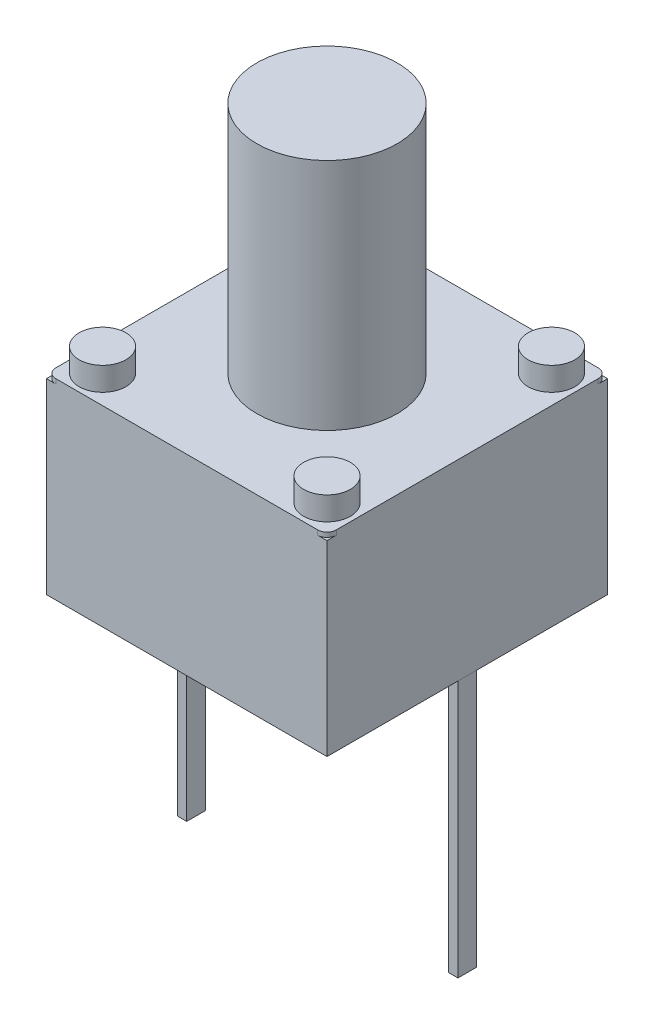
ISO-10303-21;
HEADER;
FILE_DESCRIPTION(('STEP AP214'),'2;1');
FILE_NAME('part.step','',(''),(''),'','','');
FILE_SCHEMA(('AUTOMOTIVE_DESIGN { 1 0 10303 214 1 1 1 1 }'));
ENDSEC;
DATA;
#1=APPLICATION_CONTEXT('core data for automotive mechanical design processes');
#2=APPLICATION_PROTOCOL_DEFINITION('international standard','automotive_design',2000,#1);
#3=PRODUCT_CONTEXT('',#1,'mechanical');
#4=PRODUCT('Part','Part','',(#3));
#5=PRODUCT_RELATED_PRODUCT_CATEGORY('part','',(#4));
#6=PRODUCT_DEFINITION_FORMATION('','',#4);
#7=PRODUCT_DEFINITION_CONTEXT('part definition',#1,'design');
#8=PRODUCT_DEFINITION('design','',#6,#7);
#9=PRODUCT_DEFINITION_SHAPE('','',#8);
#10=(LENGTH_UNIT() NAMED_UNIT(*) SI_UNIT(.MILLI.,.METRE.));
#11=(NAMED_UNIT(*) PLANE_ANGLE_UNIT() SI_UNIT($,.RADIAN.));
#12=(NAMED_UNIT(*) SI_UNIT($,.STERADIAN.) SOLID_ANGLE_UNIT());
#13=UNCERTAINTY_MEASURE_WITH_UNIT(LENGTH_MEASURE(1.E-05),#10,'distance_accuracy_value','');
#14=(GEOMETRIC_REPRESENTATION_CONTEXT(3) GLOBAL_UNCERTAINTY_ASSIGNED_CONTEXT((#13)) GLOBAL_UNIT_ASSIGNED_CONTEXT((#10,
#11,#12)) REPRESENTATION_CONTEXT('',''));
#15=CARTESIAN_POINT('',(0.,0.,0.));
#16=DIRECTION('',(0.,0.,1.));
#17=DIRECTION('',(1.,0.,0.));
#18=AXIS2_PLACEMENT_3D('',#15,#16,#17);
#19=CARTESIAN_POINT('',(6.,-5.5,-3.2));
#20=DIRECTION('',(0.,0.,1.));
#21=DIRECTION('',(1.,0.,0.));
#22=AXIS2_PLACEMENT_3D('',#19,#20,#21);
#23=PLANE('',#22);
#24=DIRECTION('',(1.,0.,0.));
#25=VECTOR('',#24,1.);
#26=CARTESIAN_POINT('',(6.,0.,-3.2));
#27=LINE('',#26,#25);
#28=CARTESIAN_POINT('',(5.8,0.,-3.2));
#29=VERTEX_POINT('',#28);
#30=CARTESIAN_POINT('',(6.,0.,-3.2));
#31=VERTEX_POINT('',#30);
#32=EDGE_CURVE('E107',#29,#31,#27,.T.);
#33=ORIENTED_EDGE('',*,*,#32,.T.);
#34=DIRECTION('',(0.,1.,0.));
#35=VECTOR('',#34,1.);
#36=CARTESIAN_POINT('',(6.,-5.5,-3.2));
#37=LINE('',#36,#35);
#38=CARTESIAN_POINT('',(6.,-5.5,-3.2));
#39=VERTEX_POINT('',#38);
#40=EDGE_CURVE('E12',#39,#31,#37,.T.);
#41=ORIENTED_EDGE('',*,*,#40,.F.);
#42=DIRECTION('',(1.,0.,0.));
#43=VECTOR('',#42,1.);
#44=CARTESIAN_POINT('',(6.,-5.5,-3.2));
#45=LINE('',#44,#43);
#46=CARTESIAN_POINT('',(5.8,-5.5,-3.2));
#47=VERTEX_POINT('',#46);
#48=EDGE_CURVE('E95',#47,#39,#45,.T.);
#49=ORIENTED_EDGE('',*,*,#48,.F.);
#50=DIRECTION('',(0.,1.,0.));
#51=VECTOR('',#50,1.);
#52=CARTESIAN_POINT('',(5.8,-5.5,-3.2));
#53=LINE('',#52,#51);
#54=EDGE_CURVE('E103',#47,#29,#53,.T.);
#55=ORIENTED_EDGE('',*,*,#54,.T.);
#56=EDGE_LOOP('',(#33,#41,#49,#55));
#57=FACE_BOUND('',#56,.T.);
#58=ADVANCED_FACE('F44',(#57),#23,.F.);
#59=CARTESIAN_POINT('',(6.,-5.5,-3.2));
#60=DIRECTION('',(-1.,0.,0.));
#61=DIRECTION('',(0.,0.,1.));
#62=AXIS2_PLACEMENT_3D('',#59,#60,#61);
#63=PLANE('',#62);
#64=DIRECTION('',(0.,0.,1.));
#65=VECTOR('',#64,1.);
#66=CARTESIAN_POINT('',(6.,0.,-3.2));
#67=LINE('',#66,#65);
#68=CARTESIAN_POINT('',(6.,0.,-2.8));
#69=VERTEX_POINT('',#68);
#70=EDGE_CURVE('E99',#31,#69,#67,.T.);
#71=ORIENTED_EDGE('',*,*,#70,.T.);
#72=DIRECTION('',(0.,1.,0.));
#73=VECTOR('',#72,1.);
#74=CARTESIAN_POINT('',(6.,-5.5,-2.8));
#75=LINE('',#74,#73);
#76=CARTESIAN_POINT('',(6.,-5.5,-2.8));
#77=VERTEX_POINT('',#76);
#78=EDGE_CURVE('E52',#77,#69,#75,.T.);
#79=ORIENTED_EDGE('',*,*,#78,.F.);
#80=DIRECTION('',(0.,0.,1.));
#81=VECTOR('',#80,1.);
#82=CARTESIAN_POINT('',(6.,-5.5,-3.2));
#83=LINE('',#82,#81);
#84=EDGE_CURVE('E90',#39,#77,#83,.T.);
#85=ORIENTED_EDGE('',*,*,#84,.F.);
#86=ORIENTED_EDGE('',*,*,#40,.T.);
#87=EDGE_LOOP('',(#71,#79,#85,#86));
#88=FACE_BOUND('',#87,.T.);
#89=ADVANCED_FACE('F98',(#88),#63,.F.);
#90=CARTESIAN_POINT('',(6.,-5.5,-2.8));
#91=DIRECTION('',(0.,0.,-1.));
#92=DIRECTION('',(-1.,0.,0.));
#93=AXIS2_PLACEMENT_3D('',#90,#91,#92);
#94=PLANE('',#93);
#95=DIRECTION('',(-1.,0.,0.));
#96=VECTOR('',#95,1.);
#97=CARTESIAN_POINT('',(6.,0.,-2.8));
#98=LINE('',#97,#96);
#99=CARTESIAN_POINT('',(5.8,0.,-2.8));
#100=VERTEX_POINT('',#99);
#101=EDGE_CURVE('E77',#69,#100,#98,.T.);
#102=ORIENTED_EDGE('',*,*,#101,.T.);
#103=DIRECTION('',(0.,1.,0.));
#104=VECTOR('',#103,1.);
#105=CARTESIAN_POINT('',(5.8,-5.5,-2.8));
#106=LINE('',#105,#104);
#107=CARTESIAN_POINT('',(5.8,-5.5,-2.8));
#108=VERTEX_POINT('',#107);
#109=EDGE_CURVE('E100',#108,#100,#106,.T.);
#110=ORIENTED_EDGE('',*,*,#109,.F.);
#111=DIRECTION('',(-1.,0.,0.));
#112=VECTOR('',#111,1.);
#113=CARTESIAN_POINT('',(6.,-5.5,-2.8));
#114=LINE('',#113,#112);
#115=EDGE_CURVE('E93',#77,#108,#114,.T.);
#116=ORIENTED_EDGE('',*,*,#115,.F.);
#117=ORIENTED_EDGE('',*,*,#78,.T.);
#118=EDGE_LOOP('',(#102,#110,#116,#117));
#119=FACE_BOUND('',#118,.T.);
#120=ADVANCED_FACE('F101',(#119),#94,.F.);
#121=CARTESIAN_POINT('',(5.8,-5.5,-3.2));
#122=DIRECTION('',(1.,0.,0.));
#123=DIRECTION('',(0.,0.,-1.));
#124=AXIS2_PLACEMENT_3D('',#121,#122,#123);
#125=PLANE('',#124);
#126=DIRECTION('',(0.,0.,-1.));
#127=VECTOR('',#126,1.);
#128=CARTESIAN_POINT('',(5.8,0.,-3.2));
#129=LINE('',#128,#127);
#130=EDGE_CURVE('E83',#100,#29,#129,.T.);
#131=ORIENTED_EDGE('',*,*,#130,.T.);
#132=ORIENTED_EDGE('',*,*,#54,.F.);
#133=DIRECTION('',(0.,0.,-1.));
#134=VECTOR('',#133,1.);
#135=CARTESIAN_POINT('',(5.8,-5.5,-3.2));
#136=LINE('',#135,#134);
#137=EDGE_CURVE('E60',#108,#47,#136,.T.);
#138=ORIENTED_EDGE('',*,*,#137,.F.);
#139=ORIENTED_EDGE('',*,*,#109,.T.);
#140=EDGE_LOOP('',(#131,#132,#138,#139));
#141=FACE_BOUND('',#140,.T.);
#142=ADVANCED_FACE('F114',(#141),#125,.F.);
#143=CARTESIAN_POINT('',(0.,-5.5,0.));
#144=DIRECTION('',(0.,1.,0.));
#145=DIRECTION('',(0.,0.,1.));
#146=AXIS2_PLACEMENT_3D('',#143,#144,#145);
#147=PLANE('',#146);
#148=ORIENTED_EDGE('',*,*,#48,.T.);
#149=ORIENTED_EDGE('',*,*,#84,.T.);
#150=ORIENTED_EDGE('',*,*,#115,.T.);
#151=ORIENTED_EDGE('',*,*,#137,.T.);
#152=EDGE_LOOP('',(#148,#149,#150,#151));
#153=FACE_BOUND('',#152,.T.);
#154=ADVANCED_FACE('F91',(#153),#147,.F.);
#155=CARTESIAN_POINT('',(0.,0.,0.));
#156=DIRECTION('',(0.,1.,0.));
#157=DIRECTION('',(0.,0.,1.));
#158=AXIS2_PLACEMENT_3D('',#155,#156,#157);
#159=PLANE('',#158);
#160=ORIENTED_EDGE('',*,*,#32,.F.);
#161=ORIENTED_EDGE('',*,*,#130,.F.);
#162=ORIENTED_EDGE('',*,*,#101,.F.);
#163=ORIENTED_EDGE('',*,*,#70,.F.);
#164=EDGE_LOOP('',(#160,#161,#162,#163));
#165=FACE_BOUND('',#164,.T.);
#166=ADVANCED_FACE('F117',(#165),#159,.T.);
#167=CLOSED_SHELL('',(#58,#89,#120,#142,#154,#166));
#168=MANIFOLD_SOLID_BREP('B2',#167);
#169=CARTESIAN_POINT('',(0.,-5.5,-3.2));
#170=DIRECTION('',(1.,0.,0.));
#171=DIRECTION('',(0.,0.,-1.));
#172=AXIS2_PLACEMENT_3D('',#169,#170,#171);
#173=PLANE('',#172);
#174=DIRECTION('',(0.,0.,-1.));
#175=VECTOR('',#174,1.);
#176=CARTESIAN_POINT('',(0.,0.,-3.2));
#177=LINE('',#176,#175);
#178=CARTESIAN_POINT('',(0.,0.,-2.8));
#179=VERTEX_POINT('',#178);
#180=CARTESIAN_POINT('',(0.,0.,-3.2));
#181=VERTEX_POINT('',#180);
#182=EDGE_CURVE('E240',#179,#181,#177,.T.);
#183=ORIENTED_EDGE('',*,*,#182,.T.);
#184=DIRECTION('',(0.,1.,0.));
#185=VECTOR('',#184,1.);
#186=CARTESIAN_POINT('',(0.,-5.5,-3.2));
#187=LINE('',#186,#185);
#188=CARTESIAN_POINT('',(0.,-5.5,-3.2));
#189=VERTEX_POINT('',#188);
#190=EDGE_CURVE('E42',#189,#181,#187,.T.);
#191=ORIENTED_EDGE('',*,*,#190,.F.);
#192=DIRECTION('',(0.,0.,-1.));
#193=VECTOR('',#192,1.);
#194=CARTESIAN_POINT('',(0.,-5.5,-3.2));
#195=LINE('',#194,#193);
#196=CARTESIAN_POINT('',(0.,-5.5,-2.8));
#197=VERTEX_POINT('',#196);
#198=EDGE_CURVE('E228',#197,#189,#195,.T.);
#199=ORIENTED_EDGE('',*,*,#198,.F.);
#200=DIRECTION('',(0.,1.,0.));
#201=VECTOR('',#200,1.);
#202=CARTESIAN_POINT('',(0.,-5.5,-2.8));
#203=LINE('',#202,#201);
#204=EDGE_CURVE('E236',#197,#179,#203,.T.);
#205=ORIENTED_EDGE('',*,*,#204,.T.);
#206=EDGE_LOOP('',(#183,#191,#199,#205));
#207=FACE_BOUND('',#206,.T.);
#208=ADVANCED_FACE('F177',(#207),#173,.F.);
#209=CARTESIAN_POINT('',(0.,-5.5,-3.2));
#210=DIRECTION('',(0.,0.,1.));
#211=DIRECTION('',(1.,0.,0.));
#212=AXIS2_PLACEMENT_3D('',#209,#210,#211);
#213=PLANE('',#212);
#214=DIRECTION('',(1.,0.,0.));
#215=VECTOR('',#214,1.);
#216=CARTESIAN_POINT('',(0.,0.,-3.2));
#217=LINE('',#216,#215);
#218=CARTESIAN_POINT('',(0.2,0.,-3.2));
#219=VERTEX_POINT('',#218);
#220=EDGE_CURVE('E232',#181,#219,#217,.T.);
#221=ORIENTED_EDGE('',*,*,#220,.T.);
#222=DIRECTION('',(0.,1.,0.));
#223=VECTOR('',#222,1.);
#224=CARTESIAN_POINT('',(0.2,-5.5,-3.2));
#225=LINE('',#224,#223);
#226=CARTESIAN_POINT('',(0.2,-5.5,-3.2));
#227=VERTEX_POINT('',#226);
#228=EDGE_CURVE('E185',#227,#219,#225,.T.);
#229=ORIENTED_EDGE('',*,*,#228,.F.);
#230=DIRECTION('',(1.,0.,0.));
#231=VECTOR('',#230,1.);
#232=CARTESIAN_POINT('',(0.,-5.5,-3.2));
#233=LINE('',#232,#231);
#234=EDGE_CURVE('E223',#189,#227,#233,.T.);
#235=ORIENTED_EDGE('',*,*,#234,.F.);
#236=ORIENTED_EDGE('',*,*,#190,.T.);
#237=EDGE_LOOP('',(#221,#229,#235,#236));
#238=FACE_BOUND('',#237,.T.);
#239=ADVANCED_FACE('F231',(#238),#213,.F.);
#240=CARTESIAN_POINT('',(0.2,-5.5,-3.2));
#241=DIRECTION('',(-1.,0.,0.));
#242=DIRECTION('',(0.,0.,1.));
#243=AXIS2_PLACEMENT_3D('',#240,#241,#242);
#244=PLANE('',#243);
#245=DIRECTION('',(0.,0.,1.));
#246=VECTOR('',#245,1.);
#247=CARTESIAN_POINT('',(0.2,0.,-3.2));
#248=LINE('',#247,#246);
#249=CARTESIAN_POINT('',(0.2,0.,-2.8));
#250=VERTEX_POINT('',#249);
#251=EDGE_CURVE('E210',#219,#250,#248,.T.);
#252=ORIENTED_EDGE('',*,*,#251,.T.);
#253=DIRECTION('',(0.,1.,0.));
#254=VECTOR('',#253,1.);
#255=CARTESIAN_POINT('',(0.2,-5.5,-2.8));
#256=LINE('',#255,#254);
#257=CARTESIAN_POINT('',(0.2,-5.5,-2.8));
#258=VERTEX_POINT('',#257);
#259=EDGE_CURVE('E233',#258,#250,#256,.T.);
#260=ORIENTED_EDGE('',*,*,#259,.F.);
#261=DIRECTION('',(0.,0.,1.));
#262=VECTOR('',#261,1.);
#263=CARTESIAN_POINT('',(0.2,-5.5,-3.2));
#264=LINE('',#263,#262);
#265=EDGE_CURVE('E226',#227,#258,#264,.T.);
#266=ORIENTED_EDGE('',*,*,#265,.F.);
#267=ORIENTED_EDGE('',*,*,#228,.T.);
#268=EDGE_LOOP('',(#252,#260,#266,#267));
#269=FACE_BOUND('',#268,.T.);
#270=ADVANCED_FACE('F234',(#269),#244,.F.);
#271=CARTESIAN_POINT('',(0.,-5.5,-2.8));
#272=DIRECTION('',(0.,0.,-1.));
#273=DIRECTION('',(-1.,0.,0.));
#274=AXIS2_PLACEMENT_3D('',#271,#272,#273);
#275=PLANE('',#274);
#276=DIRECTION('',(-1.,0.,0.));
#277=VECTOR('',#276,1.);
#278=CARTESIAN_POINT('',(0.,0.,-2.8));
#279=LINE('',#278,#277);
#280=EDGE_CURVE('E216',#250,#179,#279,.T.);
#281=ORIENTED_EDGE('',*,*,#280,.T.);
#282=ORIENTED_EDGE('',*,*,#204,.F.);
#283=DIRECTION('',(-1.,0.,0.));
#284=VECTOR('',#283,1.);
#285=CARTESIAN_POINT('',(0.,-5.5,-2.8));
#286=LINE('',#285,#284);
#287=EDGE_CURVE('E193',#258,#197,#286,.T.);
#288=ORIENTED_EDGE('',*,*,#287,.F.);
#289=ORIENTED_EDGE('',*,*,#259,.T.);
#290=EDGE_LOOP('',(#281,#282,#288,#289));
#291=FACE_BOUND('',#290,.T.);
#292=ADVANCED_FACE('F247',(#291),#275,.F.);
#293=CARTESIAN_POINT('',(0.,-5.5,0.));
#294=DIRECTION('',(0.,1.,0.));
#295=DIRECTION('',(0.,0.,1.));
#296=AXIS2_PLACEMENT_3D('',#293,#294,#295);
#297=PLANE('',#296);
#298=ORIENTED_EDGE('',*,*,#198,.T.);
#299=ORIENTED_EDGE('',*,*,#234,.T.);
#300=ORIENTED_EDGE('',*,*,#265,.T.);
#301=ORIENTED_EDGE('',*,*,#287,.T.);
#302=EDGE_LOOP('',(#298,#299,#300,#301));
#303=FACE_BOUND('',#302,.T.);
#304=ADVANCED_FACE('F224',(#303),#297,.F.);
#305=CARTESIAN_POINT('',(0.,0.,0.));
#306=DIRECTION('',(0.,1.,0.));
#307=DIRECTION('',(0.,0.,1.));
#308=AXIS2_PLACEMENT_3D('',#305,#306,#307);
#309=PLANE('',#308);
#310=ORIENTED_EDGE('',*,*,#182,.F.);
#311=ORIENTED_EDGE('',*,*,#280,.F.);
#312=ORIENTED_EDGE('',*,*,#251,.F.);
#313=ORIENTED_EDGE('',*,*,#220,.F.);
#314=EDGE_LOOP('',(#310,#311,#312,#313));
#315=FACE_BOUND('',#314,.T.);
#316=ADVANCED_FACE('F250',(#315),#309,.T.);
#317=CLOSED_SHELL('',(#208,#239,#270,#292,#304,#316));
#318=MANIFOLD_SOLID_BREP('B6',#317);
#319=CARTESIAN_POINT('',(0.,4.,0.));
#320=DIRECTION('',(0.,-1.,0.));
#321=DIRECTION('',(0.,0.,-1.));
#322=AXIS2_PLACEMENT_3D('',#319,#320,#321);
#323=PLANE('',#322);
#324=CARTESIAN_POINT('',(0.2,4.,-0.2));
#325=DIRECTION('',(0.,1.,0.));
#326=DIRECTION('',(0.,0.,1.));
#327=AXIS2_PLACEMENT_3D('',#324,#325,#326);
#328=CIRCLE('',#327,0.2);
#329=CARTESIAN_POINT('',(0.,4.,-0.2));
#330=VERTEX_POINT('',#329);
#331=CARTESIAN_POINT('',(0.2,4.,0.));
#332=VERTEX_POINT('',#331);
#333=EDGE_CURVE('E416',#330,#332,#328,.T.);
#334=ORIENTED_EDGE('',*,*,#333,.F.);
#335=DIRECTION('',(0.,0.,1.));
#336=VECTOR('',#335,1.);
#337=CARTESIAN_POINT('',(0.,4.,0.));
#338=LINE('',#337,#336);
#339=CARTESIAN_POINT('',(0.,4.,0.));
#340=VERTEX_POINT('',#339);
#341=EDGE_CURVE('E489',#330,#340,#338,.T.);
#342=ORIENTED_EDGE('',*,*,#341,.T.);
#343=DIRECTION('',(1.,0.,0.));
#344=VECTOR('',#343,1.);
#345=CARTESIAN_POINT('',(0.,4.,0.));
#346=LINE('',#345,#344);
#347=EDGE_CURVE('E514',#340,#332,#346,.T.);
#348=ORIENTED_EDGE('',*,*,#347,.T.);
#349=EDGE_LOOP('',(#334,#342,#348));
#350=FACE_BOUND('',#349,.T.);
#351=ADVANCED_FACE('F301',(#350),#323,.F.);
#352=CARTESIAN_POINT('',(0.2,4.,-5.8));
#353=DIRECTION('',(0.,1.,0.));
#354=DIRECTION('',(0.,0.,1.));
#355=AXIS2_PLACEMENT_3D('',#352,#353,#354);
#356=CIRCLE('',#355,0.2);
#357=CARTESIAN_POINT('',(0.2,4.,-6.));
#358=VERTEX_POINT('',#357);
#359=CARTESIAN_POINT('',(0.,4.,-5.8));
#360=VERTEX_POINT('',#359);
#361=EDGE_CURVE('E318',#358,#360,#356,.T.);
#362=ORIENTED_EDGE('',*,*,#361,.F.);
#363=DIRECTION('',(-1.,0.,0.));
#364=VECTOR('',#363,1.);
#365=CARTESIAN_POINT('',(0.,4.,-6.));
#366=LINE('',#365,#364);
#367=CARTESIAN_POINT('',(0.,4.,-6.));
#368=VERTEX_POINT('',#367);
#369=EDGE_CURVE('E448',#358,#368,#366,.T.);
#370=ORIENTED_EDGE('',*,*,#369,.T.);
#371=EDGE_CURVE('E492',#368,#360,#338,.T.);
#372=ORIENTED_EDGE('',*,*,#371,.T.);
#373=EDGE_LOOP('',(#362,#370,#372));
#374=FACE_BOUND('',#373,.T.);
#375=ADVANCED_FACE('F550',(#374),#323,.F.);
#376=CARTESIAN_POINT('',(5.8,4.,-5.8));
#377=DIRECTION('',(0.,1.,0.));
#378=DIRECTION('',(0.,0.,-1.));
#379=AXIS2_PLACEMENT_3D('',#376,#377,#378);
#380=CIRCLE('',#379,0.2);
#381=CARTESIAN_POINT('',(6.,4.,-5.8));
#382=VERTEX_POINT('',#381);
#383=CARTESIAN_POINT('',(5.8,4.,-6.));
#384=VERTEX_POINT('',#383);
#385=EDGE_CURVE('E447',#382,#384,#380,.T.);
#386=ORIENTED_EDGE('',*,*,#385,.F.);
#387=DIRECTION('',(0.,0.,-1.));
#388=VECTOR('',#387,1.);
#389=CARTESIAN_POINT('',(6.,4.,0.));
#390=LINE('',#389,#388);
#391=CARTESIAN_POINT('',(6.,4.,-6.));
#392=VERTEX_POINT('',#391);
#393=EDGE_CURVE('E511',#382,#392,#390,.T.);
#394=ORIENTED_EDGE('',*,*,#393,.T.);
#395=EDGE_CURVE('E326',#392,#384,#366,.T.);
#396=ORIENTED_EDGE('',*,*,#395,.T.);
#397=EDGE_LOOP('',(#386,#394,#396));
#398=FACE_BOUND('',#397,.T.);
#399=ADVANCED_FACE('F552',(#398),#323,.F.);
#400=CARTESIAN_POINT('',(0.,4.,0.));
#401=DIRECTION('',(1.,0.,0.));
#402=DIRECTION('',(0.,0.,-1.));
#403=AXIS2_PLACEMENT_3D('',#400,#401,#402);
#404=PLANE('',#403);
#405=DIRECTION('',(0.,0.,1.));
#406=VECTOR('',#405,1.);
#407=CARTESIAN_POINT('',(0.,0.,0.));
#408=LINE('',#407,#406);
#409=CARTESIAN_POINT('',(0.,0.,-6.));
#410=VERTEX_POINT('',#409);
#411=CARTESIAN_POINT('',(0.,0.,0.));
#412=VERTEX_POINT('',#411);
#413=EDGE_CURVE('E417',#410,#412,#408,.T.);
#414=ORIENTED_EDGE('',*,*,#413,.T.);
#415=DIRECTION('',(0.,-1.,0.));
#416=VECTOR('',#415,1.);
#417=CARTESIAN_POINT('',(0.,4.,0.));
#418=LINE('',#417,#416);
#419=EDGE_CURVE('E175',#340,#412,#418,.T.);
#420=ORIENTED_EDGE('',*,*,#419,.F.);
#421=ORIENTED_EDGE('',*,*,#341,.F.);
#422=DIRECTION('',(0.,-1.,0.));
#423=VECTOR('',#422,1.);
#424=CARTESIAN_POINT('',(0.,4.1,-0.200000000000001));
#425=LINE('',#424,#423);
#426=CARTESIAN_POINT('',(0.,4.1,-0.200000000000001));
#427=VERTEX_POINT('',#426);
#428=EDGE_CURVE('E433',#427,#330,#425,.T.);
#429=ORIENTED_EDGE('',*,*,#428,.F.);
#430=DIRECTION('',(0.,0.,1.));
#431=VECTOR('',#430,1.);
#432=CARTESIAN_POINT('',(0.,4.1,-5.8));
#433=LINE('',#432,#431);
#434=CARTESIAN_POINT('',(0.,4.1,-5.8));
#435=VERTEX_POINT('',#434);
#436=EDGE_CURVE('E410',#435,#427,#433,.T.);
#437=ORIENTED_EDGE('',*,*,#436,.F.);
#438=DIRECTION('',(0.,-1.,0.));
#439=VECTOR('',#438,1.);
#440=CARTESIAN_POINT('',(0.,4.1,-5.8));
#441=LINE('',#440,#439);
#442=EDGE_CURVE('E475',#435,#360,#441,.T.);
#443=ORIENTED_EDGE('',*,*,#442,.T.);
#444=ORIENTED_EDGE('',*,*,#371,.F.);
#445=DIRECTION('',(0.,-1.,0.));
#446=VECTOR('',#445,1.);
#447=CARTESIAN_POINT('',(0.,4.,-6.));
#448=LINE('',#447,#446);
#449=EDGE_CURVE('E500',#368,#410,#448,.T.);
#450=ORIENTED_EDGE('',*,*,#449,.T.);
#451=EDGE_LOOP('',(#414,#420,#421,#429,#437,#443,#444,#450));
#452=FACE_BOUND('',#451,.T.);
#453=ADVANCED_FACE('F303',(#452),#404,.F.);
#454=CARTESIAN_POINT('',(0.,4.,0.));
#455=DIRECTION('',(0.,0.,-1.));
#456=DIRECTION('',(-1.,0.,0.));
#457=AXIS2_PLACEMENT_3D('',#454,#455,#456);
#458=PLANE('',#457);
#459=DIRECTION('',(1.,0.,0.));
#460=VECTOR('',#459,1.);
#461=CARTESIAN_POINT('',(0.,0.,0.));
#462=LINE('',#461,#460);
#463=CARTESIAN_POINT('',(6.,0.,0.));
#464=VERTEX_POINT('',#463);
#465=EDGE_CURVE('E420',#412,#464,#462,.T.);
#466=ORIENTED_EDGE('',*,*,#465,.T.);
#467=DIRECTION('',(0.,-1.,0.));
#468=VECTOR('',#467,1.);
#469=CARTESIAN_POINT('',(6.,4.,0.));
#470=LINE('',#469,#468);
#471=CARTESIAN_POINT('',(6.,4.,0.));
#472=VERTEX_POINT('',#471);
#473=EDGE_CURVE('E310',#472,#464,#470,.T.);
#474=ORIENTED_EDGE('',*,*,#473,.F.);
#475=CARTESIAN_POINT('',(5.8,4.,0.));
#476=VERTEX_POINT('',#475);
#477=EDGE_CURVE('E493',#476,#472,#346,.T.);
#478=ORIENTED_EDGE('',*,*,#477,.F.);
#479=DIRECTION('',(0.,-1.,0.));
#480=VECTOR('',#479,1.);
#481=CARTESIAN_POINT('',(5.8,4.1,0.));
#482=LINE('',#481,#480);
#483=CARTESIAN_POINT('',(5.8,4.1,0.));
#484=VERTEX_POINT('',#483);
#485=EDGE_CURVE('E401',#484,#476,#482,.T.);
#486=ORIENTED_EDGE('',*,*,#485,.F.);
#487=DIRECTION('',(1.,0.,0.));
#488=VECTOR('',#487,1.);
#489=CARTESIAN_POINT('',(0.200000000000001,4.1,0.));
#490=LINE('',#489,#488);
#491=CARTESIAN_POINT('',(0.200000000000001,4.1,0.));
#492=VERTEX_POINT('',#491);
#493=EDGE_CURVE('E392',#492,#484,#490,.T.);
#494=ORIENTED_EDGE('',*,*,#493,.F.);
#495=DIRECTION('',(0.,-1.,0.));
#496=VECTOR('',#495,1.);
#497=CARTESIAN_POINT('',(0.200000000000001,4.1,0.));
#498=LINE('',#497,#496);
#499=EDGE_CURVE('E397',#492,#332,#498,.T.);
#500=ORIENTED_EDGE('',*,*,#499,.T.);
#501=ORIENTED_EDGE('',*,*,#347,.F.);
#502=ORIENTED_EDGE('',*,*,#419,.T.);
#503=EDGE_LOOP('',(#466,#474,#478,#486,#494,#500,#501,#502));
#504=FACE_BOUND('',#503,.T.);
#505=ADVANCED_FACE('F394',(#504),#458,.F.);
#506=CARTESIAN_POINT('',(6.,4.,0.));
#507=DIRECTION('',(-1.,0.,0.));
#508=DIRECTION('',(0.,0.,1.));
#509=AXIS2_PLACEMENT_3D('',#506,#507,#508);
#510=PLANE('',#509);
#511=DIRECTION('',(0.,0.,-1.));
#512=VECTOR('',#511,1.);
#513=CARTESIAN_POINT('',(6.,0.,0.));
#514=LINE('',#513,#512);
#515=CARTESIAN_POINT('',(6.,0.,-6.));
#516=VERTEX_POINT('',#515);
#517=EDGE_CURVE('E505',#464,#516,#514,.T.);
#518=ORIENTED_EDGE('',*,*,#517,.T.);
#519=DIRECTION('',(0.,-1.,0.));
#520=VECTOR('',#519,1.);
#521=CARTESIAN_POINT('',(6.,4.,-6.));
#522=LINE('',#521,#520);
#523=EDGE_CURVE('E497',#392,#516,#522,.T.);
#524=ORIENTED_EDGE('',*,*,#523,.F.);
#525=ORIENTED_EDGE('',*,*,#393,.F.);
#526=DIRECTION('',(0.,-1.,0.));
#527=VECTOR('',#526,1.);
#528=CARTESIAN_POINT('',(6.,4.1,-5.8));
#529=LINE('',#528,#527);
#530=CARTESIAN_POINT('',(6.,4.1,-5.8));
#531=VERTEX_POINT('',#530);
#532=EDGE_CURVE('E453',#531,#382,#529,.T.);
#533=ORIENTED_EDGE('',*,*,#532,.F.);
#534=DIRECTION('',(0.,0.,-1.));
#535=VECTOR('',#534,1.);
#536=CARTESIAN_POINT('',(6.,4.1,-5.8));
#537=LINE('',#536,#535);
#538=CARTESIAN_POINT('',(6.,4.1,-0.200000000000001));
#539=VERTEX_POINT('',#538);
#540=EDGE_CURVE('E534',#539,#531,#537,.T.);
#541=ORIENTED_EDGE('',*,*,#540,.F.);
#542=DIRECTION('',(0.,-1.,0.));
#543=VECTOR('',#542,1.);
#544=CARTESIAN_POINT('',(6.,4.1,-0.200000000000001));
#545=LINE('',#544,#543);
#546=CARTESIAN_POINT('',(6.,4.,-0.200000000000001));
#547=VERTEX_POINT('',#546);
#548=EDGE_CURVE('E422',#539,#547,#545,.T.);
#549=ORIENTED_EDGE('',*,*,#548,.T.);
#550=EDGE_CURVE('E513',#472,#547,#390,.T.);
#551=ORIENTED_EDGE('',*,*,#550,.F.);
#552=ORIENTED_EDGE('',*,*,#473,.T.);
#553=EDGE_LOOP('',(#518,#524,#525,#533,#541,#549,#551,#552));
#554=FACE_BOUND('',#553,.T.);
#555=ADVANCED_FACE('F528',(#554),#510,.F.);
#556=CARTESIAN_POINT('',(0.,4.,-6.));
#557=DIRECTION('',(0.,0.,1.));
#558=DIRECTION('',(1.,0.,0.));
#559=AXIS2_PLACEMENT_3D('',#556,#557,#558);
#560=PLANE('',#559);
#561=DIRECTION('',(-1.,0.,0.));
#562=VECTOR('',#561,1.);
#563=CARTESIAN_POINT('',(0.,0.,-6.));
#564=LINE('',#563,#562);
#565=EDGE_CURVE('E503',#516,#410,#564,.T.);
#566=ORIENTED_EDGE('',*,*,#565,.T.);
#567=ORIENTED_EDGE('',*,*,#449,.F.);
#568=ORIENTED_EDGE('',*,*,#369,.F.);
#569=DIRECTION('',(0.,-1.,0.));
#570=VECTOR('',#569,1.);
#571=CARTESIAN_POINT('',(0.200000000000001,4.1,-6.));
#572=LINE('',#571,#570);
#573=CARTESIAN_POINT('',(0.200000000000001,4.1,-6.));
#574=VERTEX_POINT('',#573);
#575=EDGE_CURVE('E465',#574,#358,#572,.T.);
#576=ORIENTED_EDGE('',*,*,#575,.F.);
#577=DIRECTION('',(-1.,0.,0.));
#578=VECTOR('',#577,1.);
#579=CARTESIAN_POINT('',(0.200000000000001,4.1,-6.));
#580=LINE('',#579,#578);
#581=CARTESIAN_POINT('',(5.8,4.1,-6.));
#582=VERTEX_POINT('',#581);
#583=EDGE_CURVE('E540',#582,#574,#580,.T.);
#584=ORIENTED_EDGE('',*,*,#583,.F.);
#585=DIRECTION('',(0.,-1.,0.));
#586=VECTOR('',#585,1.);
#587=CARTESIAN_POINT('',(5.8,4.1,-6.));
#588=LINE('',#587,#586);
#589=EDGE_CURVE('E460',#582,#384,#588,.T.);
#590=ORIENTED_EDGE('',*,*,#589,.T.);
#591=ORIENTED_EDGE('',*,*,#395,.F.);
#592=ORIENTED_EDGE('',*,*,#523,.T.);
#593=EDGE_LOOP('',(#566,#567,#568,#576,#584,#590,#591,#592));
#594=FACE_BOUND('',#593,.T.);
#595=ADVANCED_FACE('F549',(#594),#560,.F.);
#596=CARTESIAN_POINT('',(5.8,4.,-0.2));
#597=DIRECTION('',(0.,1.,0.));
#598=DIRECTION('',(0.,0.,1.));
#599=AXIS2_PLACEMENT_3D('',#596,#597,#598);
#600=CIRCLE('',#599,0.2);
#601=EDGE_CURVE('E431',#476,#547,#600,.T.);
#602=ORIENTED_EDGE('',*,*,#601,.F.);
#603=ORIENTED_EDGE('',*,*,#477,.T.);
#604=ORIENTED_EDGE('',*,*,#550,.T.);
#605=EDGE_LOOP('',(#602,#603,#604));
#606=FACE_BOUND('',#605,.T.);
#607=ADVANCED_FACE('F531',(#606),#323,.F.);
#608=CARTESIAN_POINT('',(0.,0.,0.));
#609=DIRECTION('',(0.,-1.,0.));
#610=DIRECTION('',(0.,0.,-1.));
#611=AXIS2_PLACEMENT_3D('',#608,#609,#610);
#612=PLANE('',#611);
#613=ORIENTED_EDGE('',*,*,#413,.F.);
#614=ORIENTED_EDGE('',*,*,#565,.F.);
#615=ORIENTED_EDGE('',*,*,#517,.F.);
#616=ORIENTED_EDGE('',*,*,#465,.F.);
#617=EDGE_LOOP('',(#613,#614,#615,#616));
#618=FACE_BOUND('',#617,.T.);
#619=ADVANCED_FACE('F525',(#618),#612,.T.);
#620=CARTESIAN_POINT('',(0.2,4.1,-0.2));
#621=DIRECTION('',(0.,-1.,0.));
#622=DIRECTION('',(0.,0.,-1.));
#623=AXIS2_PLACEMENT_3D('',#620,#621,#622);
#624=CYLINDRICAL_SURFACE('',#623,0.2);
#625=ORIENTED_EDGE('',*,*,#333,.T.);
#626=ORIENTED_EDGE('',*,*,#499,.F.);
#627=CARTESIAN_POINT('',(0.2,4.1,-0.2));
#628=DIRECTION('',(0.,1.,0.));
#629=DIRECTION('',(0.,0.,1.));
#630=AXIS2_PLACEMENT_3D('',#627,#628,#629);
#631=CIRCLE('',#630,0.2);
#632=EDGE_CURVE('E405',#427,#492,#631,.T.);
#633=ORIENTED_EDGE('',*,*,#632,.F.);
#634=ORIENTED_EDGE('',*,*,#428,.T.);
#635=EDGE_LOOP('',(#625,#626,#633,#634));
#636=FACE_BOUND('',#635,.T.);
#637=ADVANCED_FACE('F415',(#636),#624,.T.);
#638=CARTESIAN_POINT('',(5.8,4.1,-0.2));
#639=DIRECTION('',(0.,-1.,0.));
#640=DIRECTION('',(0.,0.,-1.));
#641=AXIS2_PLACEMENT_3D('',#638,#639,#640);
#642=CYLINDRICAL_SURFACE('',#641,0.2);
#643=ORIENTED_EDGE('',*,*,#601,.T.);
#644=ORIENTED_EDGE('',*,*,#548,.F.);
#645=CARTESIAN_POINT('',(5.8,4.1,-0.2));
#646=DIRECTION('',(0.,1.,0.));
#647=DIRECTION('',(0.,0.,1.));
#648=AXIS2_PLACEMENT_3D('',#645,#646,#647);
#649=CIRCLE('',#648,0.2);
#650=EDGE_CURVE('E404',#484,#539,#649,.T.);
#651=ORIENTED_EDGE('',*,*,#650,.F.);
#652=ORIENTED_EDGE('',*,*,#485,.T.);
#653=EDGE_LOOP('',(#643,#644,#651,#652));
#654=FACE_BOUND('',#653,.T.);
#655=ADVANCED_FACE('F533',(#654),#642,.T.);
#656=CARTESIAN_POINT('',(5.8,4.1,-5.8));
#657=DIRECTION('',(0.,-1.,0.));
#658=DIRECTION('',(0.,0.,-1.));
#659=AXIS2_PLACEMENT_3D('',#656,#657,#658);
#660=CYLINDRICAL_SURFACE('',#659,0.2);
#661=ORIENTED_EDGE('',*,*,#385,.T.);
#662=ORIENTED_EDGE('',*,*,#589,.F.);
#663=CARTESIAN_POINT('',(5.8,4.1,-5.8));
#664=DIRECTION('',(0.,1.,0.));
#665=DIRECTION('',(0.,0.,-1.));
#666=AXIS2_PLACEMENT_3D('',#663,#664,#665);
#667=CIRCLE('',#666,0.2);
#668=EDGE_CURVE('E536',#531,#582,#667,.T.);
#669=ORIENTED_EDGE('',*,*,#668,.F.);
#670=ORIENTED_EDGE('',*,*,#532,.T.);
#671=EDGE_LOOP('',(#661,#662,#669,#670));
#672=FACE_BOUND('',#671,.T.);
#673=ADVANCED_FACE('F609',(#672),#660,.T.);
#674=CARTESIAN_POINT('',(0.2,4.1,-5.8));
#675=DIRECTION('',(0.,-1.,0.));
#676=DIRECTION('',(0.,0.,-1.));
#677=AXIS2_PLACEMENT_3D('',#674,#675,#676);
#678=CYLINDRICAL_SURFACE('',#677,0.2);
#679=ORIENTED_EDGE('',*,*,#361,.T.);
#680=ORIENTED_EDGE('',*,*,#442,.F.);
#681=CARTESIAN_POINT('',(0.2,4.1,-5.8));
#682=DIRECTION('',(0.,1.,0.));
#683=DIRECTION('',(0.,0.,1.));
#684=AXIS2_PLACEMENT_3D('',#681,#682,#683);
#685=CIRCLE('',#684,0.2);
#686=EDGE_CURVE('E541',#574,#435,#685,.T.);
#687=ORIENTED_EDGE('',*,*,#686,.F.);
#688=ORIENTED_EDGE('',*,*,#575,.T.);
#689=EDGE_LOOP('',(#679,#680,#687,#688));
#690=FACE_BOUND('',#689,.T.);
#691=ADVANCED_FACE('F545',(#690),#678,.T.);
#692=CARTESIAN_POINT('',(0.2,4.1,-0.2));
#693=DIRECTION('',(0.,1.,0.));
#694=DIRECTION('',(0.,0.,1.));
#695=AXIS2_PLACEMENT_3D('',#692,#693,#694);
#696=PLANE('',#695);
#697=CARTESIAN_POINT('',(3.,4.1,-3.));
#698=DIRECTION('',(0.,1.,0.));
#699=DIRECTION('',(0.,0.,1.));
#700=AXIS2_PLACEMENT_3D('',#697,#698,#699);
#701=CIRCLE('',#700,1.5);
#702=CARTESIAN_POINT('',(3.,4.1,-1.5));
#703=VERTEX_POINT('',#702);
#704=EDGE_CURVE('E777',#703,#703,#701,.T.);
#705=ORIENTED_EDGE('',*,*,#704,.F.);
#706=EDGE_LOOP('',(#705));
#707=FACE_BOUND('',#706,.T.);
#708=CARTESIAN_POINT('',(0.60000000000005,4.1,-0.600000000000001));
#709=DIRECTION('',(0.,1.,0.));
#710=DIRECTION('',(0.,0.,1.));
#711=AXIS2_PLACEMENT_3D('',#708,#709,#710);
#712=CIRCLE('',#711,0.5);
#713=CARTESIAN_POINT('',(0.60000000000005,4.1,-0.1));
#714=VERTEX_POINT('',#713);
#715=EDGE_CURVE('E776',#714,#714,#712,.T.);
#716=ORIENTED_EDGE('',*,*,#715,.F.);
#717=EDGE_LOOP('',(#716));
#718=FACE_BOUND('',#717,.T.);
#719=CARTESIAN_POINT('',(5.40000000000005,4.1,-0.600000000000001));
#720=DIRECTION('',(0.,1.,0.));
#721=DIRECTION('',(0.,0.,1.));
#722=AXIS2_PLACEMENT_3D('',#719,#720,#721);
#723=CIRCLE('',#722,0.5);
#724=CARTESIAN_POINT('',(5.40000000000005,4.1,-0.100000000000001));
#725=VERTEX_POINT('',#724);
#726=EDGE_CURVE('E786',#725,#725,#723,.T.);
#727=ORIENTED_EDGE('',*,*,#726,.F.);
#728=EDGE_LOOP('',(#727));
#729=FACE_BOUND('',#728,.T.);
#730=CARTESIAN_POINT('',(5.4,4.1,-5.4));
#731=DIRECTION('',(0.,1.,0.));
#732=DIRECTION('',(0.,0.,1.));
#733=AXIS2_PLACEMENT_3D('',#730,#731,#732);
#734=CIRCLE('',#733,0.5);
#735=CARTESIAN_POINT('',(5.4,4.1,-4.9));
#736=VERTEX_POINT('',#735);
#737=EDGE_CURVE('E791',#736,#736,#734,.T.);
#738=ORIENTED_EDGE('',*,*,#737,.F.);
#739=EDGE_LOOP('',(#738));
#740=FACE_BOUND('',#739,.T.);
#741=CARTESIAN_POINT('',(0.6,4.1,-5.4));
#742=DIRECTION('',(0.,1.,0.));
#743=DIRECTION('',(0.,0.,1.));
#744=AXIS2_PLACEMENT_3D('',#741,#742,#743);
#745=CIRCLE('',#744,0.5);
#746=CARTESIAN_POINT('',(0.6,4.1,-4.9));
#747=VERTEX_POINT('',#746);
#748=EDGE_CURVE('E797',#747,#747,#745,.T.);
#749=ORIENTED_EDGE('',*,*,#748,.F.);
#750=EDGE_LOOP('',(#749));
#751=FACE_BOUND('',#750,.T.);
#752=ORIENTED_EDGE('',*,*,#632,.T.);
#753=ORIENTED_EDGE('',*,*,#493,.T.);
#754=ORIENTED_EDGE('',*,*,#650,.T.);
#755=ORIENTED_EDGE('',*,*,#540,.T.);
#756=ORIENTED_EDGE('',*,*,#668,.T.);
#757=ORIENTED_EDGE('',*,*,#583,.T.);
#758=ORIENTED_EDGE('',*,*,#686,.T.);
#759=ORIENTED_EDGE('',*,*,#436,.T.);
#760=EDGE_LOOP('',(#752,#753,#754,#755,#756,#757,#758,#759));
#761=FACE_BOUND('',#760,.T.);
#762=ADVANCED_FACE('F408',(#707,#718,#729,#740,#751,#761),#696,.T.);
#763=CARTESIAN_POINT('',(0.6,4.6,-5.4));
#764=DIRECTION('',(0.,-1.,0.));
#765=DIRECTION('',(0.,0.,-1.));
#766=AXIS2_PLACEMENT_3D('',#763,#764,#765);
#767=CYLINDRICAL_SURFACE('',#766,0.5);
#768=CARTESIAN_POINT('',(0.6,4.6,-5.4));
#769=DIRECTION('',(0.,1.,0.));
#770=DIRECTION('',(0.,0.,1.));
#771=AXIS2_PLACEMENT_3D('',#768,#769,#770);
#772=CIRCLE('',#771,0.5);
#773=CARTESIAN_POINT('',(0.6,4.6,-4.9));
#774=VERTEX_POINT('',#773);
#775=EDGE_CURVE('E432',#774,#774,#772,.T.);
#776=ORIENTED_EDGE('',*,*,#775,.F.);
#777=EDGE_LOOP('',(#776));
#778=FACE_BOUND('',#777,.T.);
#779=ORIENTED_EDGE('',*,*,#748,.T.);
#780=EDGE_LOOP('',(#779));
#781=FACE_BOUND('',#780,.T.);
#782=ADVANCED_FACE('F628',(#778,#781),#767,.T.);
#783=CARTESIAN_POINT('',(0.6,4.6,-5.4));
#784=DIRECTION('',(0.,1.,0.));
#785=DIRECTION('',(0.,0.,1.));
#786=AXIS2_PLACEMENT_3D('',#783,#784,#785);
#787=PLANE('',#786);
#788=ORIENTED_EDGE('',*,*,#775,.T.);
#789=EDGE_LOOP('',(#788));
#790=FACE_BOUND('',#789,.T.);
#791=ADVANCED_FACE('F637',(#790),#787,.T.);
#792=CARTESIAN_POINT('',(5.4,4.6,-5.4));
#793=DIRECTION('',(0.,-1.,0.));
#794=DIRECTION('',(0.,0.,-1.));
#795=AXIS2_PLACEMENT_3D('',#792,#793,#794);
#796=CYLINDRICAL_SURFACE('',#795,0.5);
#797=CARTESIAN_POINT('',(5.4,4.6,-5.4));
#798=DIRECTION('',(0.,1.,0.));
#799=DIRECTION('',(0.,0.,1.));
#800=AXIS2_PLACEMENT_3D('',#797,#798,#799);
#801=CIRCLE('',#800,0.5);
#802=CARTESIAN_POINT('',(5.4,4.6,-4.9));
#803=VERTEX_POINT('',#802);
#804=EDGE_CURVE('E794',#803,#803,#801,.T.);
#805=ORIENTED_EDGE('',*,*,#804,.F.);
#806=EDGE_LOOP('',(#805));
#807=FACE_BOUND('',#806,.T.);
#808=ORIENTED_EDGE('',*,*,#737,.T.);
#809=EDGE_LOOP('',(#808));
#810=FACE_BOUND('',#809,.T.);
#811=ADVANCED_FACE('F645',(#807,#810),#796,.T.);
#812=CARTESIAN_POINT('',(5.4,4.6,-5.4));
#813=DIRECTION('',(0.,1.,0.));
#814=DIRECTION('',(0.,0.,1.));
#815=AXIS2_PLACEMENT_3D('',#812,#813,#814);
#816=PLANE('',#815);
#817=ORIENTED_EDGE('',*,*,#804,.T.);
#818=EDGE_LOOP('',(#817));
#819=FACE_BOUND('',#818,.T.);
#820=ADVANCED_FACE('F653',(#819),#816,.T.);
#821=CARTESIAN_POINT('',(5.40000000000005,4.6,-0.600000000000001));
#822=DIRECTION('',(0.,-1.,0.));
#823=DIRECTION('',(0.,0.,-1.));
#824=AXIS2_PLACEMENT_3D('',#821,#822,#823);
#825=CYLINDRICAL_SURFACE('',#824,0.5);
#826=CARTESIAN_POINT('',(5.40000000000005,4.6,-0.600000000000001));
#827=DIRECTION('',(0.,1.,0.));
#828=DIRECTION('',(0.,0.,1.));
#829=AXIS2_PLACEMENT_3D('',#826,#827,#828);
#830=CIRCLE('',#829,0.5);
#831=CARTESIAN_POINT('',(5.40000000000005,4.6,-0.100000000000001));
#832=VERTEX_POINT('',#831);
#833=EDGE_CURVE('E788',#832,#832,#830,.T.);
#834=ORIENTED_EDGE('',*,*,#833,.F.);
#835=EDGE_LOOP('',(#834));
#836=FACE_BOUND('',#835,.T.);
#837=ORIENTED_EDGE('',*,*,#726,.T.);
#838=EDGE_LOOP('',(#837));
#839=FACE_BOUND('',#838,.T.);
#840=ADVANCED_FACE('F661',(#836,#839),#825,.T.);
#841=CARTESIAN_POINT('',(5.40000000000005,4.6,-0.600000000000001));
#842=DIRECTION('',(0.,1.,0.));
#843=DIRECTION('',(0.,0.,1.));
#844=AXIS2_PLACEMENT_3D('',#841,#842,#843);
#845=PLANE('',#844);
#846=ORIENTED_EDGE('',*,*,#833,.T.);
#847=EDGE_LOOP('',(#846));
#848=FACE_BOUND('',#847,.T.);
#849=ADVANCED_FACE('F669',(#848),#845,.T.);
#850=CARTESIAN_POINT('',(0.60000000000005,4.6,-0.600000000000001));
#851=DIRECTION('',(0.,-1.,0.));
#852=DIRECTION('',(0.,0.,-1.));
#853=AXIS2_PLACEMENT_3D('',#850,#851,#852);
#854=CYLINDRICAL_SURFACE('',#853,0.5);
#855=CARTESIAN_POINT('',(0.60000000000005,4.6,-0.600000000000001));
#856=DIRECTION('',(0.,1.,0.));
#857=DIRECTION('',(0.,0.,1.));
#858=AXIS2_PLACEMENT_3D('',#855,#856,#857);
#859=CIRCLE('',#858,0.5);
#860=CARTESIAN_POINT('',(0.60000000000005,4.6,-0.1));
#861=VERTEX_POINT('',#860);
#862=EDGE_CURVE('E780',#861,#861,#859,.T.);
#863=ORIENTED_EDGE('',*,*,#862,.F.);
#864=EDGE_LOOP('',(#863));
#865=FACE_BOUND('',#864,.T.);
#866=ORIENTED_EDGE('',*,*,#715,.T.);
#867=EDGE_LOOP('',(#866));
#868=FACE_BOUND('',#867,.T.);
#869=ADVANCED_FACE('F677',(#865,#868),#854,.T.);
#870=CARTESIAN_POINT('',(0.60000000000005,4.6,-0.600000000000001));
#871=DIRECTION('',(0.,1.,0.));
#872=DIRECTION('',(0.,0.,1.));
#873=AXIS2_PLACEMENT_3D('',#870,#871,#872);
#874=PLANE('',#873);
#875=ORIENTED_EDGE('',*,*,#862,.T.);
#876=EDGE_LOOP('',(#875));
#877=FACE_BOUND('',#876,.T.);
#878=ADVANCED_FACE('F685',(#877),#874,.T.);
#879=CARTESIAN_POINT('',(3.,9.1,-3.));
#880=DIRECTION('',(0.,-1.,0.));
#881=DIRECTION('',(0.,0.,-1.));
#882=AXIS2_PLACEMENT_3D('',#879,#880,#881);
#883=CYLINDRICAL_SURFACE('',#882,1.5);
#884=CARTESIAN_POINT('',(3.,9.1,-3.));
#885=DIRECTION('',(0.,1.,0.));
#886=DIRECTION('',(0.,0.,1.));
#887=AXIS2_PLACEMENT_3D('',#884,#885,#886);
#888=CIRCLE('',#887,1.5);
#889=CARTESIAN_POINT('',(3.,9.1,-1.5));
#890=VERTEX_POINT('',#889);
#891=EDGE_CURVE('E775',#890,#890,#888,.T.);
#892=ORIENTED_EDGE('',*,*,#891,.F.);
#893=EDGE_LOOP('',(#892));
#894=FACE_BOUND('',#893,.T.);
#895=ORIENTED_EDGE('',*,*,#704,.T.);
#896=EDGE_LOOP('',(#895));
#897=FACE_BOUND('',#896,.T.);
#898=ADVANCED_FACE('F692',(#894,#897),#883,.T.);
#899=CARTESIAN_POINT('',(3.,9.1,-3.));
#900=DIRECTION('',(0.,1.,0.));
#901=DIRECTION('',(0.,0.,1.));
#902=AXIS2_PLACEMENT_3D('',#899,#900,#901);
#903=PLANE('',#902);
#904=ORIENTED_EDGE('',*,*,#891,.T.);
#905=EDGE_LOOP('',(#904));
#906=FACE_BOUND('',#905,.T.);
#907=ADVANCED_FACE('F699',(#906),#903,.T.);
#908=CLOSED_SHELL('',(#351,#375,#399,#453,#505,#555,#595,#607,#619,#637,#655,#673,#691,#762,
#782,#791,#811,#820,#840,#849,#869,#878,#898,#907));
#909=MANIFOLD_SOLID_BREP('B36',#908);
#910=ADVANCED_BREP_SHAPE_REPRESENTATION('',(#18,#168,#318,#909),#14);
#911=SHAPE_DEFINITION_REPRESENTATION(#9,#910);
ENDSEC;
END-ISO-10303-21;
